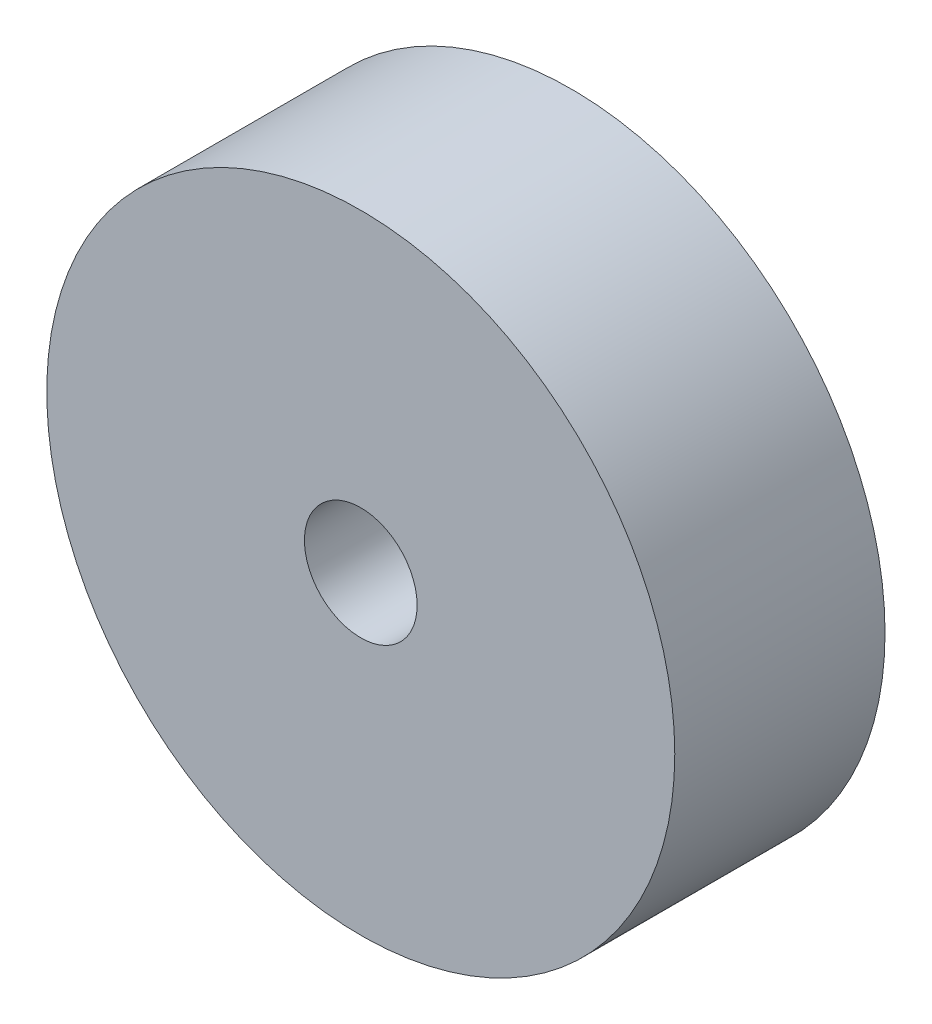
ISO-10303-21;
HEADER;
FILE_DESCRIPTION(('STEP AP214'),'2;1');
FILE_NAME('part.step','',(''),(''),'','','');
FILE_SCHEMA(('AUTOMOTIVE_DESIGN { 1 0 10303 214 1 1 1 1 }'));
ENDSEC;
DATA;
#1=APPLICATION_CONTEXT('core data for automotive mechanical design processes');
#2=APPLICATION_PROTOCOL_DEFINITION('international standard','automotive_design',2000,#1);
#3=PRODUCT_CONTEXT('',#1,'mechanical');
#4=PRODUCT('Part','Part','',(#3));
#5=PRODUCT_RELATED_PRODUCT_CATEGORY('part','',(#4));
#6=PRODUCT_DEFINITION_FORMATION('','',#4);
#7=PRODUCT_DEFINITION_CONTEXT('part definition',#1,'design');
#8=PRODUCT_DEFINITION('design','',#6,#7);
#9=PRODUCT_DEFINITION_SHAPE('','',#8);
#10=(LENGTH_UNIT() NAMED_UNIT(*) SI_UNIT(.MILLI.,.METRE.));
#11=(NAMED_UNIT(*) PLANE_ANGLE_UNIT() SI_UNIT($,.RADIAN.));
#12=(NAMED_UNIT(*) SI_UNIT($,.STERADIAN.) SOLID_ANGLE_UNIT());
#13=UNCERTAINTY_MEASURE_WITH_UNIT(LENGTH_MEASURE(1.E-05),#10,'distance_accuracy_value','');
#14=(GEOMETRIC_REPRESENTATION_CONTEXT(3) GLOBAL_UNCERTAINTY_ASSIGNED_CONTEXT((#13)) GLOBAL_UNIT_ASSIGNED_CONTEXT((#10,
#11,#12)) REPRESENTATION_CONTEXT('',''));
#15=CARTESIAN_POINT('',(0.,0.,0.));
#16=DIRECTION('',(0.,0.,1.));
#17=DIRECTION('',(1.,0.,0.));
#18=AXIS2_PLACEMENT_3D('',#15,#16,#17);
#19=CARTESIAN_POINT('',(0.,0.,9.525));
#20=DIRECTION('',(0.,0.,-1.));
#21=DIRECTION('',(-1.,0.,0.));
#22=AXIS2_PLACEMENT_3D('',#19,#20,#21);
#23=CYLINDRICAL_SURFACE('',#22,14.224);
#24=CARTESIAN_POINT('',(0.,0.,9.525));
#25=DIRECTION('',(0.,0.,1.));
#26=DIRECTION('',(1.,0.,0.));
#27=AXIS2_PLACEMENT_3D('',#24,#25,#26);
#28=CIRCLE('',#27,14.224);
#29=CARTESIAN_POINT('',(14.224,0.,9.525));
#30=VERTEX_POINT('',#29);
#31=EDGE_CURVE('E10',#30,#30,#28,.T.);
#32=ORIENTED_EDGE('',*,*,#31,.F.);
#33=EDGE_LOOP('',(#32));
#34=FACE_BOUND('',#33,.T.);
#35=CARTESIAN_POINT('',(0.,0.,0.));
#36=DIRECTION('',(0.,0.,1.));
#37=DIRECTION('',(1.,0.,0.));
#38=AXIS2_PLACEMENT_3D('',#35,#36,#37);
#39=CIRCLE('',#38,14.224);
#40=CARTESIAN_POINT('',(14.224,0.,0.));
#41=VERTEX_POINT('',#40);
#42=EDGE_CURVE('E34',#41,#41,#39,.T.);
#43=ORIENTED_EDGE('',*,*,#42,.T.);
#44=EDGE_LOOP('',(#43));
#45=FACE_BOUND('',#44,.T.);
#46=ADVANCED_FACE('F31',(#34,#45),#23,.T.);
#47=CARTESIAN_POINT('',(0.,0.,9.525));
#48=DIRECTION('',(0.,0.,1.));
#49=DIRECTION('',(1.,0.,0.));
#50=AXIS2_PLACEMENT_3D('',#47,#48,#49);
#51=PLANE('',#50);
#52=CARTESIAN_POINT('',(0.,0.,9.525));
#53=DIRECTION('',(0.,0.,1.));
#54=DIRECTION('',(1.,0.,0.));
#55=AXIS2_PLACEMENT_3D('',#52,#53,#54);
#56=CIRCLE('',#55,2.5527);
#57=CARTESIAN_POINT('',(2.5527,0.,9.525));
#58=VERTEX_POINT('',#57);
#59=EDGE_CURVE('E45',#58,#58,#56,.T.);
#60=ORIENTED_EDGE('',*,*,#59,.F.);
#61=EDGE_LOOP('',(#60));
#62=FACE_BOUND('',#61,.T.);
#63=ORIENTED_EDGE('',*,*,#31,.T.);
#64=EDGE_LOOP('',(#63));
#65=FACE_BOUND('',#64,.T.);
#66=ADVANCED_FACE('F51',(#62,#65),#51,.T.);
#67=CARTESIAN_POINT('',(0.,0.,0.));
#68=DIRECTION('',(0.,0.,1.));
#69=DIRECTION('',(1.,0.,0.));
#70=AXIS2_PLACEMENT_3D('',#67,#68,#69);
#71=PLANE('',#70);
#72=CARTESIAN_POINT('',(0.,0.,0.));
#73=DIRECTION('',(0.,0.,1.));
#74=DIRECTION('',(1.,0.,0.));
#75=AXIS2_PLACEMENT_3D('',#72,#73,#74);
#76=CIRCLE('',#75,2.5527);
#77=CARTESIAN_POINT('',(2.5527,0.,0.));
#78=VERTEX_POINT('',#77);
#79=EDGE_CURVE('E41',#78,#78,#76,.T.);
#80=ORIENTED_EDGE('',*,*,#79,.T.);
#81=EDGE_LOOP('',(#80));
#82=FACE_BOUND('',#81,.T.);
#83=ORIENTED_EDGE('',*,*,#42,.F.);
#84=EDGE_LOOP('',(#83));
#85=FACE_BOUND('',#84,.T.);
#86=ADVANCED_FACE('F53',(#82,#85),#71,.F.);
#87=CARTESIAN_POINT('',(0.,0.,9.525));
#88=DIRECTION('',(0.,0.,1.));
#89=DIRECTION('',(1.,0.,0.));
#90=AXIS2_PLACEMENT_3D('',#87,#88,#89);
#91=CYLINDRICAL_SURFACE('',#90,2.5527);
#92=ORIENTED_EDGE('',*,*,#79,.F.);
#93=EDGE_LOOP('',(#92));
#94=FACE_BOUND('',#93,.T.);
#95=ORIENTED_EDGE('',*,*,#59,.T.);
#96=EDGE_LOOP('',(#95));
#97=FACE_BOUND('',#96,.T.);
#98=ADVANCED_FACE('F49',(#94,#97),#91,.F.);
#99=CLOSED_SHELL('',(#46,#66,#86,#98));
#100=MANIFOLD_SOLID_BREP('B2',#99);
#101=ADVANCED_BREP_SHAPE_REPRESENTATION('',(#18,#100),#14);
#102=SHAPE_DEFINITION_REPRESENTATION(#9,#101);
ENDSEC;
END-ISO-10303-21;
